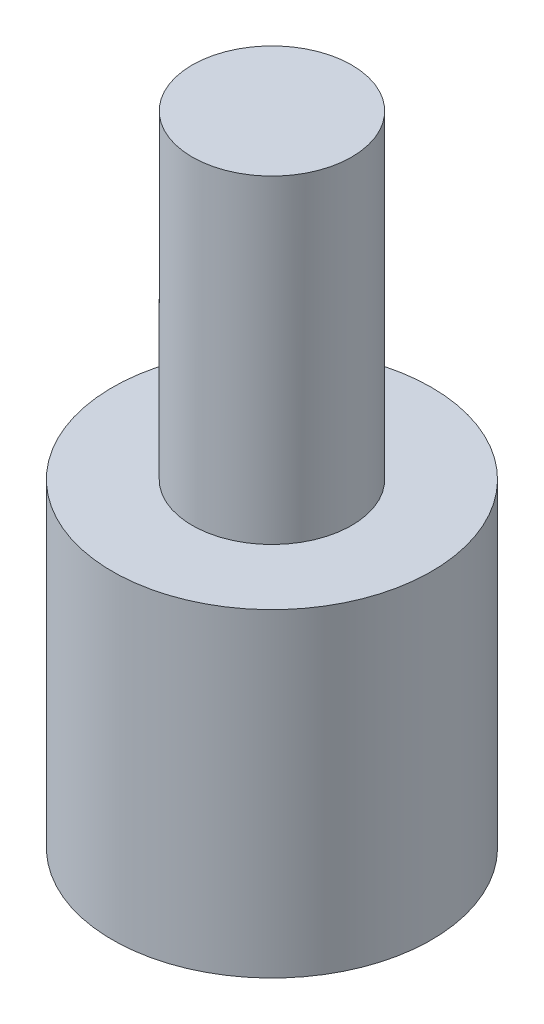
ISO-10303-21;
HEADER;
FILE_DESCRIPTION(('STEP AP214'),'2;1');
FILE_NAME('part.step','',(''),(''),'','','');
FILE_SCHEMA(('AUTOMOTIVE_DESIGN { 1 0 10303 214 1 1 1 1 }'));
ENDSEC;
DATA;
#1=APPLICATION_CONTEXT('core data for automotive mechanical design processes');
#2=APPLICATION_PROTOCOL_DEFINITION('international standard','automotive_design',2000,#1);
#3=PRODUCT_CONTEXT('',#1,'mechanical');
#4=PRODUCT('Part','Part','',(#3));
#5=PRODUCT_RELATED_PRODUCT_CATEGORY('part','',(#4));
#6=PRODUCT_DEFINITION_FORMATION('','',#4);
#7=PRODUCT_DEFINITION_CONTEXT('part definition',#1,'design');
#8=PRODUCT_DEFINITION('design','',#6,#7);
#9=PRODUCT_DEFINITION_SHAPE('','',#8);
#10=(LENGTH_UNIT() NAMED_UNIT(*) SI_UNIT(.MILLI.,.METRE.));
#11=(NAMED_UNIT(*) PLANE_ANGLE_UNIT() SI_UNIT($,.RADIAN.));
#12=(NAMED_UNIT(*) SI_UNIT($,.STERADIAN.) SOLID_ANGLE_UNIT());
#13=UNCERTAINTY_MEASURE_WITH_UNIT(LENGTH_MEASURE(1.E-05),#10,'distance_accuracy_value','');
#14=(GEOMETRIC_REPRESENTATION_CONTEXT(3) GLOBAL_UNCERTAINTY_ASSIGNED_CONTEXT((#13)) GLOBAL_UNIT_ASSIGNED_CONTEXT((#10,
#11,#12)) REPRESENTATION_CONTEXT('',''));
#15=CARTESIAN_POINT('',(0.,0.,0.));
#16=DIRECTION('',(0.,0.,1.));
#17=DIRECTION('',(1.,0.,0.));
#18=AXIS2_PLACEMENT_3D('',#15,#16,#17);
#19=CARTESIAN_POINT('',(0.,10.,0.));
#20=DIRECTION('',(0.,-1.,0.));
#21=DIRECTION('',(0.,0.,-1.));
#22=AXIS2_PLACEMENT_3D('',#19,#20,#21);
#23=CYLINDRICAL_SURFACE('',#22,2.5);
#24=CARTESIAN_POINT('',(0.,10.,0.));
#25=DIRECTION('',(0.,1.,0.));
#26=DIRECTION('',(0.,0.,1.));
#27=AXIS2_PLACEMENT_3D('',#24,#25,#26);
#28=CIRCLE('',#27,2.5);
#29=CARTESIAN_POINT('',(0.,10.,2.5));
#30=VERTEX_POINT('',#29);
#31=EDGE_CURVE('E10',#30,#30,#28,.T.);
#32=ORIENTED_EDGE('',*,*,#31,.F.);
#33=EDGE_LOOP('',(#32));
#34=FACE_BOUND('',#33,.T.);
#35=CARTESIAN_POINT('',(0.,0.,0.));
#36=DIRECTION('',(0.,-1.,0.));
#37=DIRECTION('',(0.,0.,-1.));
#38=AXIS2_PLACEMENT_3D('',#35,#36,#37);
#39=CIRCLE('',#38,2.5);
#40=CARTESIAN_POINT('',(0.,0.,-2.5));
#41=VERTEX_POINT('',#40);
#42=EDGE_CURVE('E38',#41,#41,#39,.T.);
#43=ORIENTED_EDGE('',*,*,#42,.F.);
#44=EDGE_LOOP('',(#43));
#45=FACE_BOUND('',#44,.T.);
#46=ADVANCED_FACE('F32',(#34,#45),#23,.T.);
#47=CARTESIAN_POINT('',(0.,10.,0.));
#48=DIRECTION('',(0.,1.,0.));
#49=DIRECTION('',(0.,0.,1.));
#50=AXIS2_PLACEMENT_3D('',#47,#48,#49);
#51=PLANE('',#50);
#52=ORIENTED_EDGE('',*,*,#31,.T.);
#53=EDGE_LOOP('',(#52));
#54=FACE_BOUND('',#53,.T.);
#55=ADVANCED_FACE('F56',(#54),#51,.T.);
#56=CARTESIAN_POINT('',(0.,0.,0.));
#57=DIRECTION('',(0.,-1.,0.));
#58=DIRECTION('',(0.,0.,-1.));
#59=AXIS2_PLACEMENT_3D('',#56,#57,#58);
#60=PLANE('',#59);
#61=CARTESIAN_POINT('',(0.,0.,0.));
#62=DIRECTION('',(0.,-1.,0.));
#63=DIRECTION('',(0.,0.,-1.));
#64=AXIS2_PLACEMENT_3D('',#61,#62,#63);
#65=CIRCLE('',#64,5.);
#66=CARTESIAN_POINT('',(0.,0.,-5.));
#67=VERTEX_POINT('',#66);
#68=EDGE_CURVE('E46',#67,#67,#65,.T.);
#69=ORIENTED_EDGE('',*,*,#68,.F.);
#70=EDGE_LOOP('',(#69));
#71=FACE_BOUND('',#70,.T.);
#72=ORIENTED_EDGE('',*,*,#42,.T.);
#73=EDGE_LOOP('',(#72));
#74=FACE_BOUND('',#73,.T.);
#75=ADVANCED_FACE('F54',(#71,#74),#60,.F.);
#76=CARTESIAN_POINT('',(0.,-10.,0.));
#77=DIRECTION('',(0.,1.,0.));
#78=DIRECTION('',(0.,0.,1.));
#79=AXIS2_PLACEMENT_3D('',#76,#77,#78);
#80=CYLINDRICAL_SURFACE('',#79,5.);
#81=CARTESIAN_POINT('',(0.,-10.,0.));
#82=DIRECTION('',(0.,-1.,0.));
#83=DIRECTION('',(0.,0.,-1.));
#84=AXIS2_PLACEMENT_3D('',#81,#82,#83);
#85=CIRCLE('',#84,5.);
#86=CARTESIAN_POINT('',(0.,-10.,-5.));
#87=VERTEX_POINT('',#86);
#88=EDGE_CURVE('E42',#87,#87,#85,.T.);
#89=ORIENTED_EDGE('',*,*,#88,.F.);
#90=EDGE_LOOP('',(#89));
#91=FACE_BOUND('',#90,.T.);
#92=ORIENTED_EDGE('',*,*,#68,.T.);
#93=EDGE_LOOP('',(#92));
#94=FACE_BOUND('',#93,.T.);
#95=ADVANCED_FACE('F52',(#91,#94),#80,.T.);
#96=CARTESIAN_POINT('',(0.,-10.,0.));
#97=DIRECTION('',(0.,-1.,0.));
#98=DIRECTION('',(0.,0.,-1.));
#99=AXIS2_PLACEMENT_3D('',#96,#97,#98);
#100=PLANE('',#99);
#101=ORIENTED_EDGE('',*,*,#88,.T.);
#102=EDGE_LOOP('',(#101));
#103=FACE_BOUND('',#102,.T.);
#104=ADVANCED_FACE('F62',(#103),#100,.T.);
#105=CLOSED_SHELL('',(#46,#55,#75,#95,#104));
#106=MANIFOLD_SOLID_BREP('B2',#105);
#107=ADVANCED_BREP_SHAPE_REPRESENTATION('',(#18,#106),#14);
#108=SHAPE_DEFINITION_REPRESENTATION(#9,#107);
ENDSEC;
END-ISO-10303-21;
